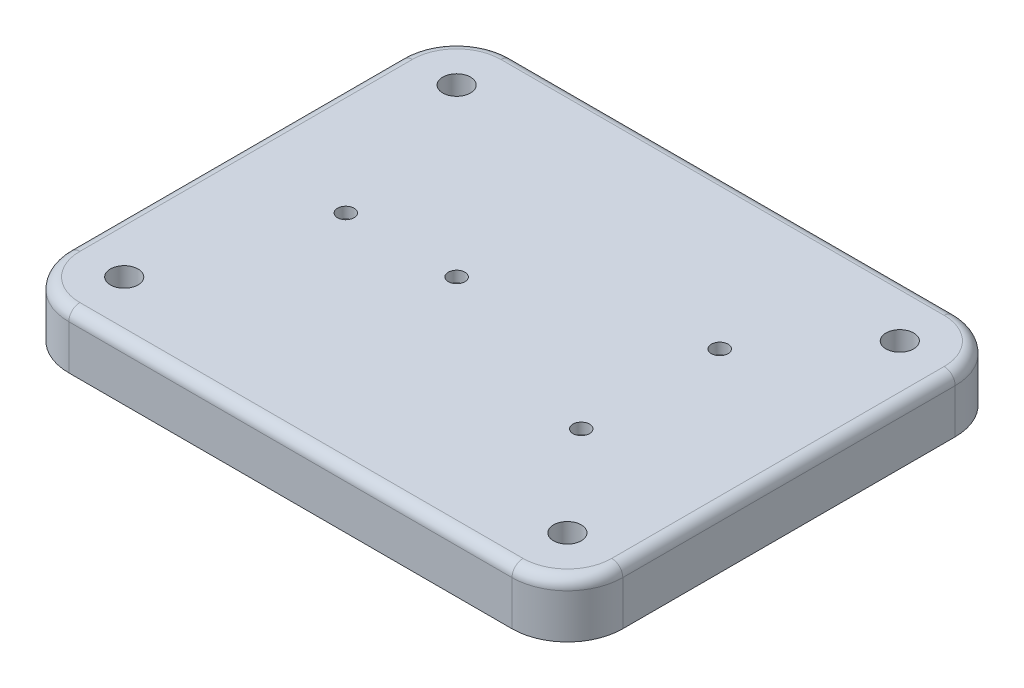
ISO-10303-21;
HEADER;
FILE_DESCRIPTION(('STEP AP214'),'2;1');
FILE_NAME('part.step','',(''),(''),'','','');
FILE_SCHEMA(('AUTOMOTIVE_DESIGN { 1 0 10303 214 1 1 1 1 }'));
ENDSEC;
DATA;
#1=APPLICATION_CONTEXT('core data for automotive mechanical design processes');
#2=APPLICATION_PROTOCOL_DEFINITION('international standard','automotive_design',2000,#1);
#3=PRODUCT_CONTEXT('',#1,'mechanical');
#4=PRODUCT('Part','Part','',(#3));
#5=PRODUCT_RELATED_PRODUCT_CATEGORY('part','',(#4));
#6=PRODUCT_DEFINITION_FORMATION('','',#4);
#7=PRODUCT_DEFINITION_CONTEXT('part definition',#1,'design');
#8=PRODUCT_DEFINITION('design','',#6,#7);
#9=PRODUCT_DEFINITION_SHAPE('','',#8);
#10=(LENGTH_UNIT() NAMED_UNIT(*) SI_UNIT(.MILLI.,.METRE.));
#11=(NAMED_UNIT(*) PLANE_ANGLE_UNIT() SI_UNIT($,.RADIAN.));
#12=(NAMED_UNIT(*) SI_UNIT($,.STERADIAN.) SOLID_ANGLE_UNIT());
#13=UNCERTAINTY_MEASURE_WITH_UNIT(LENGTH_MEASURE(1.E-05),#10,'distance_accuracy_value','');
#14=(GEOMETRIC_REPRESENTATION_CONTEXT(3) GLOBAL_UNCERTAINTY_ASSIGNED_CONTEXT((#13)) GLOBAL_UNIT_ASSIGNED_CONTEXT((#10,
#11,#12)) REPRESENTATION_CONTEXT('',''));
#15=CARTESIAN_POINT('',(0.,0.,0.));
#16=DIRECTION('',(0.,0.,1.));
#17=DIRECTION('',(1.,0.,0.));
#18=AXIS2_PLACEMENT_3D('',#15,#16,#17);
#19=CARTESIAN_POINT('',(0.,0.,0.));
#20=DIRECTION('',(0.,-1.,0.));
#21=DIRECTION('',(0.,0.,-1.));
#22=AXIS2_PLACEMENT_3D('',#19,#20,#21);
#23=PLANE('',#22);
#24=CARTESIAN_POINT('',(-40.,0.,30.));
#25=DIRECTION('',(0.,-1.,0.));
#26=DIRECTION('',(0.,0.,-1.));
#27=AXIS2_PLACEMENT_3D('',#24,#25,#26);
#28=CIRCLE('',#27,4.5);
#29=CARTESIAN_POINT('',(-40.,0.,25.5));
#30=VERTEX_POINT('',#29);
#31=EDGE_CURVE('E245',#30,#30,#28,.F.);
#32=ORIENTED_EDGE('',*,*,#31,.F.);
#33=EDGE_LOOP('',(#32));
#34=FACE_BOUND('',#33,.T.);
#35=CARTESIAN_POINT('',(-40.,0.,30.));
#36=DIRECTION('',(0.,1.,0.));
#37=DIRECTION('',(0.,0.,1.));
#38=AXIS2_PLACEMENT_3D('',#35,#36,#37);
#39=CIRCLE('',#38,2.5);
#40=CARTESIAN_POINT('',(-40.,0.,32.5));
#41=VERTEX_POINT('',#40);
#42=EDGE_CURVE('E319',#41,#41,#39,.T.);
#43=ORIENTED_EDGE('',*,*,#42,.T.);
#44=EDGE_LOOP('',(#43));
#45=FACE_BOUND('',#44,.T.);
#46=ADVANCED_FACE('F39',(#34,#45),#23,.T.);
#47=CARTESIAN_POINT('',(40.,0.,-30.));
#48=DIRECTION('',(0.,-1.,0.));
#49=DIRECTION('',(0.,0.,-1.));
#50=AXIS2_PLACEMENT_3D('',#47,#48,#49);
#51=CIRCLE('',#50,4.5);
#52=CARTESIAN_POINT('',(40.,0.,-34.5));
#53=VERTEX_POINT('',#52);
#54=EDGE_CURVE('E246',#53,#53,#51,.F.);
#55=ORIENTED_EDGE('',*,*,#54,.F.);
#56=EDGE_LOOP('',(#55));
#57=FACE_BOUND('',#56,.T.);
#58=CARTESIAN_POINT('',(40.,0.,-30.));
#59=DIRECTION('',(0.,1.,0.));
#60=DIRECTION('',(0.,0.,1.));
#61=AXIS2_PLACEMENT_3D('',#58,#59,#60);
#62=CIRCLE('',#61,2.5);
#63=CARTESIAN_POINT('',(40.,0.,-27.5));
#64=VERTEX_POINT('',#63);
#65=EDGE_CURVE('E328',#64,#64,#62,.T.);
#66=ORIENTED_EDGE('',*,*,#65,.T.);
#67=EDGE_LOOP('',(#66));
#68=FACE_BOUND('',#67,.T.);
#69=ADVANCED_FACE('F564',(#57,#68),#23,.T.);
#70=CARTESIAN_POINT('',(40.,0.,30.));
#71=DIRECTION('',(0.,-1.,0.));
#72=DIRECTION('',(0.,0.,-1.));
#73=AXIS2_PLACEMENT_3D('',#70,#71,#72);
#74=CIRCLE('',#73,4.5);
#75=CARTESIAN_POINT('',(40.,0.,25.5));
#76=VERTEX_POINT('',#75);
#77=EDGE_CURVE('E251',#76,#76,#74,.F.);
#78=ORIENTED_EDGE('',*,*,#77,.F.);
#79=EDGE_LOOP('',(#78));
#80=FACE_BOUND('',#79,.T.);
#81=CARTESIAN_POINT('',(40.,0.,30.));
#82=DIRECTION('',(0.,1.,0.));
#83=DIRECTION('',(0.,0.,1.));
#84=AXIS2_PLACEMENT_3D('',#81,#82,#83);
#85=CIRCLE('',#84,2.5);
#86=CARTESIAN_POINT('',(40.,0.,32.5));
#87=VERTEX_POINT('',#86);
#88=EDGE_CURVE('E309',#87,#87,#85,.T.);
#89=ORIENTED_EDGE('',*,*,#88,.T.);
#90=EDGE_LOOP('',(#89));
#91=FACE_BOUND('',#90,.T.);
#92=ADVANCED_FACE('F570',(#80,#91),#23,.T.);
#93=DIRECTION('',(0.,0.,-1.));
#94=VECTOR('',#93,1.);
#95=CARTESIAN_POINT('',(50.,0.,40.));
#96=LINE('',#95,#94);
#97=CARTESIAN_POINT('',(50.,0.,30.));
#98=VERTEX_POINT('',#97);
#99=CARTESIAN_POINT('',(50.,0.,-30.));
#100=VERTEX_POINT('',#99);
#101=EDGE_CURVE('E339',#98,#100,#96,.T.);
#102=ORIENTED_EDGE('',*,*,#101,.F.);
#103=CARTESIAN_POINT('',(40.,0.,30.));
#104=DIRECTION('',(0.,-1.,0.));
#105=DIRECTION('',(0.,0.,-1.));
#106=AXIS2_PLACEMENT_3D('',#103,#104,#105);
#107=CIRCLE('',#106,10.);
#108=CARTESIAN_POINT('',(40.,0.,40.));
#109=VERTEX_POINT('',#108);
#110=EDGE_CURVE('E374',#98,#109,#107,.T.);
#111=ORIENTED_EDGE('',*,*,#110,.T.);
#112=DIRECTION('',(1.,0.,0.));
#113=VECTOR('',#112,1.);
#114=CARTESIAN_POINT('',(-50.,0.,40.));
#115=LINE('',#114,#113);
#116=CARTESIAN_POINT('',(-40.,0.,40.));
#117=VERTEX_POINT('',#116);
#118=EDGE_CURVE('E354',#117,#109,#115,.T.);
#119=ORIENTED_EDGE('',*,*,#118,.F.);
#120=CARTESIAN_POINT('',(-40.,0.,30.));
#121=DIRECTION('',(0.,-1.,0.));
#122=DIRECTION('',(0.,0.,-1.));
#123=AXIS2_PLACEMENT_3D('',#120,#121,#122);
#124=CIRCLE('',#123,10.);
#125=CARTESIAN_POINT('',(-50.,0.,30.));
#126=VERTEX_POINT('',#125);
#127=EDGE_CURVE('E365',#117,#126,#124,.T.);
#128=ORIENTED_EDGE('',*,*,#127,.T.);
#129=DIRECTION('',(0.,0.,1.));
#130=VECTOR('',#129,1.);
#131=CARTESIAN_POINT('',(-50.,0.,40.));
#132=LINE('',#131,#130);
#133=CARTESIAN_POINT('',(-50.,0.,-30.));
#134=VERTEX_POINT('',#133);
#135=EDGE_CURVE('E350',#134,#126,#132,.T.);
#136=ORIENTED_EDGE('',*,*,#135,.F.);
#137=CARTESIAN_POINT('',(-40.,0.,-30.));
#138=DIRECTION('',(0.,-1.,0.));
#139=DIRECTION('',(0.,0.,-1.));
#140=AXIS2_PLACEMENT_3D('',#137,#138,#139);
#141=CIRCLE('',#140,10.);
#142=CARTESIAN_POINT('',(-40.,0.,-40.));
#143=VERTEX_POINT('',#142);
#144=EDGE_CURVE('E368',#134,#143,#141,.T.);
#145=ORIENTED_EDGE('',*,*,#144,.T.);
#146=DIRECTION('',(-1.,0.,0.));
#147=VECTOR('',#146,1.);
#148=CARTESIAN_POINT('',(-50.,0.,-40.));
#149=LINE('',#148,#147);
#150=CARTESIAN_POINT('',(40.,0.,-40.));
#151=VERTEX_POINT('',#150);
#152=EDGE_CURVE('E346',#151,#143,#149,.T.);
#153=ORIENTED_EDGE('',*,*,#152,.F.);
#154=CARTESIAN_POINT('',(40.,0.,-30.));
#155=DIRECTION('',(0.,-1.,0.));
#156=DIRECTION('',(0.,0.,-1.));
#157=AXIS2_PLACEMENT_3D('',#154,#155,#156);
#158=CIRCLE('',#157,10.);
#159=EDGE_CURVE('E371',#151,#100,#158,.T.);
#160=ORIENTED_EDGE('',*,*,#159,.T.);
#161=EDGE_LOOP('',(#102,#111,#119,#128,#136,#145,#153,#160));
#162=FACE_BOUND('',#161,.T.);
#163=CARTESIAN_POINT('',(40.,0.,30.));
#164=DIRECTION('',(0.,-1.,0.));
#165=DIRECTION('',(0.,0.,-1.));
#166=AXIS2_PLACEMENT_3D('',#163,#164,#165);
#167=CIRCLE('',#166,8.);
#168=CARTESIAN_POINT('',(48.,0.,30.));
#169=VERTEX_POINT('',#168);
#170=CARTESIAN_POINT('',(40.,0.,38.));
#171=VERTEX_POINT('',#170);
#172=EDGE_CURVE('E277',#169,#171,#167,.T.);
#173=ORIENTED_EDGE('',*,*,#172,.F.);
#174=DIRECTION('',(0.,0.,-1.));
#175=VECTOR('',#174,1.);
#176=CARTESIAN_POINT('',(48.,0.,0.));
#177=LINE('',#176,#175);
#178=CARTESIAN_POINT('',(48.,0.,-30.));
#179=VERTEX_POINT('',#178);
#180=EDGE_CURVE('E280',#169,#179,#177,.T.);
#181=ORIENTED_EDGE('',*,*,#180,.T.);
#182=CARTESIAN_POINT('',(40.,0.,-30.));
#183=DIRECTION('',(0.,-1.,0.));
#184=DIRECTION('',(0.,0.,-1.));
#185=AXIS2_PLACEMENT_3D('',#182,#183,#184);
#186=CIRCLE('',#185,8.);
#187=CARTESIAN_POINT('',(40.,0.,-38.));
#188=VERTEX_POINT('',#187);
#189=EDGE_CURVE('E206',#188,#179,#186,.T.);
#190=ORIENTED_EDGE('',*,*,#189,.F.);
#191=DIRECTION('',(-1.,0.,0.));
#192=VECTOR('',#191,1.);
#193=CARTESIAN_POINT('',(0.,0.,-38.));
#194=LINE('',#193,#192);
#195=CARTESIAN_POINT('',(-40.,0.,-38.));
#196=VERTEX_POINT('',#195);
#197=EDGE_CURVE('E57',#188,#196,#194,.T.);
#198=ORIENTED_EDGE('',*,*,#197,.T.);
#199=CARTESIAN_POINT('',(-40.,0.,-30.));
#200=DIRECTION('',(0.,-1.,0.));
#201=DIRECTION('',(0.,0.,-1.));
#202=AXIS2_PLACEMENT_3D('',#199,#200,#201);
#203=CIRCLE('',#202,8.);
#204=CARTESIAN_POINT('',(-48.,0.,-30.));
#205=VERTEX_POINT('',#204);
#206=EDGE_CURVE('E287',#205,#196,#203,.T.);
#207=ORIENTED_EDGE('',*,*,#206,.F.);
#208=DIRECTION('',(0.,0.,1.));
#209=VECTOR('',#208,1.);
#210=CARTESIAN_POINT('',(-48.,0.,0.));
#211=LINE('',#210,#209);
#212=CARTESIAN_POINT('',(-48.,0.,30.));
#213=VERTEX_POINT('',#212);
#214=EDGE_CURVE('E215',#205,#213,#211,.T.);
#215=ORIENTED_EDGE('',*,*,#214,.T.);
#216=CARTESIAN_POINT('',(-40.,0.,30.));
#217=DIRECTION('',(0.,-1.,0.));
#218=DIRECTION('',(0.,0.,-1.));
#219=AXIS2_PLACEMENT_3D('',#216,#217,#218);
#220=CIRCLE('',#219,8.);
#221=CARTESIAN_POINT('',(-40.,0.,38.));
#222=VERTEX_POINT('',#221);
#223=EDGE_CURVE('E212',#222,#213,#220,.T.);
#224=ORIENTED_EDGE('',*,*,#223,.F.);
#225=DIRECTION('',(1.,0.,0.));
#226=VECTOR('',#225,1.);
#227=CARTESIAN_POINT('',(0.,0.,38.));
#228=LINE('',#227,#226);
#229=EDGE_CURVE('E208',#222,#171,#228,.T.);
#230=ORIENTED_EDGE('',*,*,#229,.T.);
#231=EDGE_LOOP('',(#173,#181,#190,#198,#207,#215,#224,#230));
#232=FACE_BOUND('',#231,.T.);
#233=ADVANCED_FACE('F578',(#162,#232),#23,.T.);
#234=CARTESIAN_POINT('',(50.,10.,40.));
#235=DIRECTION('',(-1.,0.,0.));
#236=DIRECTION('',(0.,0.,1.));
#237=AXIS2_PLACEMENT_3D('',#234,#235,#236);
#238=PLANE('',#237);
#239=DIRECTION('',(0.,-1.,0.));
#240=VECTOR('',#239,1.);
#241=CARTESIAN_POINT('',(50.,10.,-30.));
#242=LINE('',#241,#240);
#243=CARTESIAN_POINT('',(50.,8.,-30.));
#244=VERTEX_POINT('',#243);
#245=EDGE_CURVE('E358',#100,#244,#242,.F.);
#246=ORIENTED_EDGE('',*,*,#245,.T.);
#247=DIRECTION('',(0.,0.,-1.));
#248=VECTOR('',#247,1.);
#249=CARTESIAN_POINT('',(50.,8.,40.));
#250=LINE('',#249,#248);
#251=CARTESIAN_POINT('',(50.,8.,30.));
#252=VERTEX_POINT('',#251);
#253=EDGE_CURVE('E426',#244,#252,#250,.F.);
#254=ORIENTED_EDGE('',*,*,#253,.T.);
#255=DIRECTION('',(0.,-1.,0.));
#256=VECTOR('',#255,1.);
#257=CARTESIAN_POINT('',(50.,10.,30.));
#258=LINE('',#257,#256);
#259=EDGE_CURVE('E362',#252,#98,#258,.T.);
#260=ORIENTED_EDGE('',*,*,#259,.T.);
#261=ORIENTED_EDGE('',*,*,#101,.T.);
#262=EDGE_LOOP('',(#246,#254,#260,#261));
#263=FACE_BOUND('',#262,.T.);
#264=ADVANCED_FACE('F588',(#263),#238,.F.);
#265=CARTESIAN_POINT('',(-50.,10.,-40.));
#266=DIRECTION('',(0.,0.,1.));
#267=DIRECTION('',(1.,0.,0.));
#268=AXIS2_PLACEMENT_3D('',#265,#266,#267);
#269=PLANE('',#268);
#270=DIRECTION('',(0.,-1.,0.));
#271=VECTOR('',#270,1.);
#272=CARTESIAN_POINT('',(-40.,10.,-40.));
#273=LINE('',#272,#271);
#274=CARTESIAN_POINT('',(-40.,8.,-40.));
#275=VERTEX_POINT('',#274);
#276=EDGE_CURVE('E383',#143,#275,#273,.F.);
#277=ORIENTED_EDGE('',*,*,#276,.T.);
#278=DIRECTION('',(-1.,0.,0.));
#279=VECTOR('',#278,1.);
#280=CARTESIAN_POINT('',(-50.,8.,-40.));
#281=LINE('',#280,#279);
#282=CARTESIAN_POINT('',(40.,8.,-40.));
#283=VERTEX_POINT('',#282);
#284=EDGE_CURVE('E432',#275,#283,#281,.F.);
#285=ORIENTED_EDGE('',*,*,#284,.T.);
#286=DIRECTION('',(0.,-1.,0.));
#287=VECTOR('',#286,1.);
#288=CARTESIAN_POINT('',(40.,10.,-40.));
#289=LINE('',#288,#287);
#290=EDGE_CURVE('E387',#283,#151,#289,.T.);
#291=ORIENTED_EDGE('',*,*,#290,.T.);
#292=ORIENTED_EDGE('',*,*,#152,.T.);
#293=EDGE_LOOP('',(#277,#285,#291,#292));
#294=FACE_BOUND('',#293,.T.);
#295=ADVANCED_FACE('F594',(#294),#269,.F.);
#296=CARTESIAN_POINT('',(-50.,10.,40.));
#297=DIRECTION('',(1.,0.,0.));
#298=DIRECTION('',(0.,0.,-1.));
#299=AXIS2_PLACEMENT_3D('',#296,#297,#298);
#300=PLANE('',#299);
#301=DIRECTION('',(0.,-1.,0.));
#302=VECTOR('',#301,1.);
#303=CARTESIAN_POINT('',(-50.,10.,30.));
#304=LINE('',#303,#302);
#305=CARTESIAN_POINT('',(-50.,8.,30.));
#306=VERTEX_POINT('',#305);
#307=EDGE_CURVE('E390',#126,#306,#304,.F.);
#308=ORIENTED_EDGE('',*,*,#307,.T.);
#309=DIRECTION('',(0.,0.,1.));
#310=VECTOR('',#309,1.);
#311=CARTESIAN_POINT('',(-50.,8.,40.));
#312=LINE('',#311,#310);
#313=CARTESIAN_POINT('',(-50.,8.,-30.));
#314=VERTEX_POINT('',#313);
#315=EDGE_CURVE('E438',#306,#314,#312,.F.);
#316=ORIENTED_EDGE('',*,*,#315,.T.);
#317=DIRECTION('',(0.,-1.,0.));
#318=VECTOR('',#317,1.);
#319=CARTESIAN_POINT('',(-50.,10.,-30.));
#320=LINE('',#319,#318);
#321=EDGE_CURVE('E394',#314,#134,#320,.T.);
#322=ORIENTED_EDGE('',*,*,#321,.T.);
#323=ORIENTED_EDGE('',*,*,#135,.T.);
#324=EDGE_LOOP('',(#308,#316,#322,#323));
#325=FACE_BOUND('',#324,.T.);
#326=ADVANCED_FACE('F858',(#325),#300,.F.);
#327=CARTESIAN_POINT('',(-50.,10.,40.));
#328=DIRECTION('',(0.,0.,-1.));
#329=DIRECTION('',(-1.,0.,0.));
#330=AXIS2_PLACEMENT_3D('',#327,#328,#329);
#331=PLANE('',#330);
#332=DIRECTION('',(0.,-1.,0.));
#333=VECTOR('',#332,1.);
#334=CARTESIAN_POINT('',(40.,10.,40.));
#335=LINE('',#334,#333);
#336=CARTESIAN_POINT('',(40.,8.,40.));
#337=VERTEX_POINT('',#336);
#338=EDGE_CURVE('E380',#109,#337,#335,.F.);
#339=ORIENTED_EDGE('',*,*,#338,.T.);
#340=DIRECTION('',(1.,0.,0.));
#341=VECTOR('',#340,1.);
#342=CARTESIAN_POINT('',(-50.,8.,40.));
#343=LINE('',#342,#341);
#344=CARTESIAN_POINT('',(-40.,8.,40.));
#345=VERTEX_POINT('',#344);
#346=EDGE_CURVE('E11',#337,#345,#343,.F.);
#347=ORIENTED_EDGE('',*,*,#346,.T.);
#348=DIRECTION('',(0.,-1.,0.));
#349=VECTOR('',#348,1.);
#350=CARTESIAN_POINT('',(-40.,10.,40.));
#351=LINE('',#350,#349);
#352=EDGE_CURVE('E377',#345,#117,#351,.T.);
#353=ORIENTED_EDGE('',*,*,#352,.T.);
#354=ORIENTED_EDGE('',*,*,#118,.T.);
#355=EDGE_LOOP('',(#339,#347,#353,#354));
#356=FACE_BOUND('',#355,.T.);
#357=ADVANCED_FACE('F529',(#356),#331,.F.);
#358=CARTESIAN_POINT('',(0.,10.,0.));
#359=DIRECTION('',(0.,-1.,0.));
#360=DIRECTION('',(0.,0.,-1.));
#361=AXIS2_PLACEMENT_3D('',#358,#359,#360);
#362=PLANE('',#361);
#363=CARTESIAN_POINT('',(25.,10.,12.5));
#364=DIRECTION('',(0.,1.,0.));
#365=DIRECTION('',(0.,0.,1.));
#366=AXIS2_PLACEMENT_3D('',#363,#364,#365);
#367=CIRCLE('',#366,1.5);
#368=CARTESIAN_POINT('',(25.,10.,14.));
#369=VERTEX_POINT('',#368);
#370=EDGE_CURVE('E519',#369,#369,#367,.T.);
#371=ORIENTED_EDGE('',*,*,#370,.F.);
#372=EDGE_LOOP('',(#371));
#373=FACE_BOUND('',#372,.T.);
#374=CARTESIAN_POINT('',(25.,10.,-12.5));
#375=DIRECTION('',(0.,1.,0.));
#376=DIRECTION('',(0.,0.,1.));
#377=AXIS2_PLACEMENT_3D('',#374,#375,#376);
#378=CIRCLE('',#377,1.5);
#379=CARTESIAN_POINT('',(25.,10.,-11.));
#380=VERTEX_POINT('',#379);
#381=EDGE_CURVE('E513',#380,#380,#378,.T.);
#382=ORIENTED_EDGE('',*,*,#381,.F.);
#383=EDGE_LOOP('',(#382));
#384=FACE_BOUND('',#383,.T.);
#385=CARTESIAN_POINT('',(-30.,10.,0.));
#386=DIRECTION('',(0.,1.,0.));
#387=DIRECTION('',(0.,0.,1.));
#388=AXIS2_PLACEMENT_3D('',#385,#386,#387);
#389=CIRCLE('',#388,1.5);
#390=CARTESIAN_POINT('',(-30.,10.,1.5));
#391=VERTEX_POINT('',#390);
#392=EDGE_CURVE('E510',#391,#391,#389,.T.);
#393=ORIENTED_EDGE('',*,*,#392,.F.);
#394=EDGE_LOOP('',(#393));
#395=FACE_BOUND('',#394,.T.);
#396=CARTESIAN_POINT('',(-10.,10.,0.));
#397=DIRECTION('',(0.,1.,0.));
#398=DIRECTION('',(0.,0.,1.));
#399=AXIS2_PLACEMENT_3D('',#396,#397,#398);
#400=CIRCLE('',#399,1.5);
#401=CARTESIAN_POINT('',(-10.,10.,1.5));
#402=VERTEX_POINT('',#401);
#403=EDGE_CURVE('E218',#402,#402,#400,.T.);
#404=ORIENTED_EDGE('',*,*,#403,.F.);
#405=EDGE_LOOP('',(#404));
#406=FACE_BOUND('',#405,.T.);
#407=DIRECTION('',(1.,0.,0.));
#408=VECTOR('',#407,1.);
#409=CARTESIAN_POINT('',(0.,10.,38.));
#410=LINE('',#409,#408);
#411=CARTESIAN_POINT('',(-40.,10.,38.));
#412=VERTEX_POINT('',#411);
#413=CARTESIAN_POINT('',(40.,10.,38.));
#414=VERTEX_POINT('',#413);
#415=EDGE_CURVE('E397',#412,#414,#410,.T.);
#416=ORIENTED_EDGE('',*,*,#415,.T.);
#417=CARTESIAN_POINT('',(40.,10.,30.));
#418=DIRECTION('',(0.,-1.,0.));
#419=DIRECTION('',(0.,0.,-1.));
#420=AXIS2_PLACEMENT_3D('',#417,#418,#419);
#421=CIRCLE('',#420,8.);
#422=CARTESIAN_POINT('',(48.,10.,30.));
#423=VERTEX_POINT('',#422);
#424=EDGE_CURVE('E418',#414,#423,#421,.F.);
#425=ORIENTED_EDGE('',*,*,#424,.T.);
#426=DIRECTION('',(0.,0.,-1.));
#427=VECTOR('',#426,1.);
#428=CARTESIAN_POINT('',(48.,10.,0.));
#429=LINE('',#428,#427);
#430=CARTESIAN_POINT('',(48.,10.,-30.));
#431=VERTEX_POINT('',#430);
#432=EDGE_CURVE('E415',#423,#431,#429,.T.);
#433=ORIENTED_EDGE('',*,*,#432,.T.);
#434=CARTESIAN_POINT('',(40.,10.,-30.));
#435=DIRECTION('',(0.,-1.,0.));
#436=DIRECTION('',(0.,0.,-1.));
#437=AXIS2_PLACEMENT_3D('',#434,#435,#436);
#438=CIRCLE('',#437,8.);
#439=CARTESIAN_POINT('',(40.,10.,-38.));
#440=VERTEX_POINT('',#439);
#441=EDGE_CURVE('E412',#431,#440,#438,.F.);
#442=ORIENTED_EDGE('',*,*,#441,.T.);
#443=DIRECTION('',(-1.,0.,0.));
#444=VECTOR('',#443,1.);
#445=CARTESIAN_POINT('',(0.,10.,-38.));
#446=LINE('',#445,#444);
#447=CARTESIAN_POINT('',(-40.,10.,-38.));
#448=VERTEX_POINT('',#447);
#449=EDGE_CURVE('E409',#440,#448,#446,.T.);
#450=ORIENTED_EDGE('',*,*,#449,.T.);
#451=CARTESIAN_POINT('',(-40.,10.,-30.));
#452=DIRECTION('',(0.,-1.,0.));
#453=DIRECTION('',(0.,0.,-1.));
#454=AXIS2_PLACEMENT_3D('',#451,#452,#453);
#455=CIRCLE('',#454,8.);
#456=CARTESIAN_POINT('',(-48.,10.,-30.));
#457=VERTEX_POINT('',#456);
#458=EDGE_CURVE('E406',#448,#457,#455,.F.);
#459=ORIENTED_EDGE('',*,*,#458,.T.);
#460=DIRECTION('',(0.,0.,1.));
#461=VECTOR('',#460,1.);
#462=CARTESIAN_POINT('',(-48.,10.,0.));
#463=LINE('',#462,#461);
#464=CARTESIAN_POINT('',(-48.,10.,30.));
#465=VERTEX_POINT('',#464);
#466=EDGE_CURVE('E403',#457,#465,#463,.T.);
#467=ORIENTED_EDGE('',*,*,#466,.T.);
#468=CARTESIAN_POINT('',(-40.,10.,30.));
#469=DIRECTION('',(0.,-1.,0.));
#470=DIRECTION('',(0.,0.,-1.));
#471=AXIS2_PLACEMENT_3D('',#468,#469,#470);
#472=CIRCLE('',#471,8.);
#473=EDGE_CURVE('E400',#465,#412,#472,.F.);
#474=ORIENTED_EDGE('',*,*,#473,.T.);
#475=EDGE_LOOP('',(#416,#425,#433,#442,#450,#459,#467,#474));
#476=FACE_BOUND('',#475,.T.);
#477=CARTESIAN_POINT('',(-40.,10.,30.));
#478=DIRECTION('',(0.,1.,0.));
#479=DIRECTION('',(0.,0.,1.));
#480=AXIS2_PLACEMENT_3D('',#477,#478,#479);
#481=CIRCLE('',#480,2.5);
#482=CARTESIAN_POINT('',(-40.,10.,32.5));
#483=VERTEX_POINT('',#482);
#484=EDGE_CURVE('E324',#483,#483,#481,.T.);
#485=ORIENTED_EDGE('',*,*,#484,.F.);
#486=EDGE_LOOP('',(#485));
#487=FACE_BOUND('',#486,.T.);
#488=CARTESIAN_POINT('',(40.,10.,-30.));
#489=DIRECTION('',(0.,1.,0.));
#490=DIRECTION('',(0.,0.,1.));
#491=AXIS2_PLACEMENT_3D('',#488,#489,#490);
#492=CIRCLE('',#491,2.5);
#493=CARTESIAN_POINT('',(40.,10.,-27.5));
#494=VERTEX_POINT('',#493);
#495=EDGE_CURVE('E313',#494,#494,#492,.T.);
#496=ORIENTED_EDGE('',*,*,#495,.F.);
#497=EDGE_LOOP('',(#496));
#498=FACE_BOUND('',#497,.T.);
#499=CARTESIAN_POINT('',(40.,10.,30.));
#500=DIRECTION('',(0.,1.,0.));
#501=DIRECTION('',(0.,0.,1.));
#502=AXIS2_PLACEMENT_3D('',#499,#500,#501);
#503=CIRCLE('',#502,2.5);
#504=CARTESIAN_POINT('',(40.,10.,32.5));
#505=VERTEX_POINT('',#504);
#506=EDGE_CURVE('E314',#505,#505,#503,.T.);
#507=ORIENTED_EDGE('',*,*,#506,.F.);
#508=EDGE_LOOP('',(#507));
#509=FACE_BOUND('',#508,.T.);
#510=CARTESIAN_POINT('',(-40.,10.,-30.));
#511=DIRECTION('',(0.,1.,0.));
#512=DIRECTION('',(0.,0.,1.));
#513=AXIS2_PLACEMENT_3D('',#510,#511,#512);
#514=CIRCLE('',#513,2.5);
#515=CARTESIAN_POINT('',(-40.,10.,-27.5));
#516=VERTEX_POINT('',#515);
#517=EDGE_CURVE('E323',#516,#516,#514,.T.);
#518=ORIENTED_EDGE('',*,*,#517,.F.);
#519=EDGE_LOOP('',(#518));
#520=FACE_BOUND('',#519,.T.);
#521=ADVANCED_FACE('F525',(#373,#384,#395,#406,#476,#487,#498,#509,#520),#362,.F.);
#522=CARTESIAN_POINT('',(-40.,0.,-30.));
#523=DIRECTION('',(0.,-1.,0.));
#524=DIRECTION('',(0.,0.,-1.));
#525=AXIS2_PLACEMENT_3D('',#522,#523,#524);
#526=CIRCLE('',#525,4.5);
#527=CARTESIAN_POINT('',(-40.,0.,-34.5));
#528=VERTEX_POINT('',#527);
#529=EDGE_CURVE('E260',#528,#528,#526,.F.);
#530=ORIENTED_EDGE('',*,*,#529,.F.);
#531=EDGE_LOOP('',(#530));
#532=FACE_BOUND('',#531,.T.);
#533=CARTESIAN_POINT('',(-40.,0.,-30.));
#534=DIRECTION('',(0.,1.,0.));
#535=DIRECTION('',(0.,0.,1.));
#536=AXIS2_PLACEMENT_3D('',#533,#534,#535);
#537=CIRCLE('',#536,2.5);
#538=CARTESIAN_POINT('',(-40.,0.,-27.5));
#539=VERTEX_POINT('',#538);
#540=EDGE_CURVE('E335',#539,#539,#537,.T.);
#541=ORIENTED_EDGE('',*,*,#540,.T.);
#542=EDGE_LOOP('',(#541));
#543=FACE_BOUND('',#542,.T.);
#544=ADVANCED_FACE('F528',(#532,#543),#23,.T.);
#545=CARTESIAN_POINT('',(40.,10.,30.));
#546=DIRECTION('',(0.,-1.,0.));
#547=DIRECTION('',(0.,0.,-1.));
#548=AXIS2_PLACEMENT_3D('',#545,#546,#547);
#549=CYLINDRICAL_SURFACE('',#548,10.);
#550=ORIENTED_EDGE('',*,*,#259,.F.);
#551=CARTESIAN_POINT('',(40.,8.,30.));
#552=DIRECTION('',(0.,-1.,0.));
#553=DIRECTION('',(0.,0.,-1.));
#554=AXIS2_PLACEMENT_3D('',#551,#552,#553);
#555=CIRCLE('',#554,10.);
#556=EDGE_CURVE('E422',#252,#337,#555,.T.);
#557=ORIENTED_EDGE('',*,*,#556,.T.);
#558=ORIENTED_EDGE('',*,*,#338,.F.);
#559=ORIENTED_EDGE('',*,*,#110,.F.);
#560=EDGE_LOOP('',(#550,#557,#558,#559));
#561=FACE_BOUND('',#560,.T.);
#562=ADVANCED_FACE('F576',(#561),#549,.T.);
#563=CARTESIAN_POINT('',(40.,10.,-30.));
#564=DIRECTION('',(0.,-1.,0.));
#565=DIRECTION('',(0.,0.,-1.));
#566=AXIS2_PLACEMENT_3D('',#563,#564,#565);
#567=CYLINDRICAL_SURFACE('',#566,10.);
#568=ORIENTED_EDGE('',*,*,#290,.F.);
#569=CARTESIAN_POINT('',(40.,8.,-30.));
#570=DIRECTION('',(0.,-1.,0.));
#571=DIRECTION('',(0.,0.,-1.));
#572=AXIS2_PLACEMENT_3D('',#569,#570,#571);
#573=CIRCLE('',#572,10.);
#574=EDGE_CURVE('E429',#283,#244,#573,.T.);
#575=ORIENTED_EDGE('',*,*,#574,.T.);
#576=ORIENTED_EDGE('',*,*,#245,.F.);
#577=ORIENTED_EDGE('',*,*,#159,.F.);
#578=EDGE_LOOP('',(#568,#575,#576,#577));
#579=FACE_BOUND('',#578,.T.);
#580=ADVANCED_FACE('F582',(#579),#567,.T.);
#581=CARTESIAN_POINT('',(-40.,10.,-30.));
#582=DIRECTION('',(0.,-1.,0.));
#583=DIRECTION('',(0.,0.,-1.));
#584=AXIS2_PLACEMENT_3D('',#581,#582,#583);
#585=CYLINDRICAL_SURFACE('',#584,10.);
#586=ORIENTED_EDGE('',*,*,#321,.F.);
#587=CARTESIAN_POINT('',(-40.,8.,-30.));
#588=DIRECTION('',(0.,-1.,0.));
#589=DIRECTION('',(0.,0.,-1.));
#590=AXIS2_PLACEMENT_3D('',#587,#588,#589);
#591=CIRCLE('',#590,10.);
#592=EDGE_CURVE('E435',#314,#275,#591,.T.);
#593=ORIENTED_EDGE('',*,*,#592,.T.);
#594=ORIENTED_EDGE('',*,*,#276,.F.);
#595=ORIENTED_EDGE('',*,*,#144,.F.);
#596=EDGE_LOOP('',(#586,#593,#594,#595));
#597=FACE_BOUND('',#596,.T.);
#598=ADVANCED_FACE('F558',(#597),#585,.T.);
#599=CARTESIAN_POINT('',(-40.,10.,30.));
#600=DIRECTION('',(0.,-1.,0.));
#601=DIRECTION('',(0.,0.,-1.));
#602=AXIS2_PLACEMENT_3D('',#599,#600,#601);
#603=CYLINDRICAL_SURFACE('',#602,10.);
#604=ORIENTED_EDGE('',*,*,#352,.F.);
#605=CARTESIAN_POINT('',(-40.,8.,30.));
#606=DIRECTION('',(0.,-1.,0.));
#607=DIRECTION('',(0.,0.,-1.));
#608=AXIS2_PLACEMENT_3D('',#605,#606,#607);
#609=CIRCLE('',#608,10.);
#610=EDGE_CURVE('E49',#345,#306,#609,.T.);
#611=ORIENTED_EDGE('',*,*,#610,.T.);
#612=ORIENTED_EDGE('',*,*,#307,.F.);
#613=ORIENTED_EDGE('',*,*,#127,.F.);
#614=EDGE_LOOP('',(#604,#611,#612,#613));
#615=FACE_BOUND('',#614,.T.);
#616=ADVANCED_FACE('F548',(#615),#603,.T.);
#617=CARTESIAN_POINT('',(-40.,0.,-30.));
#618=DIRECTION('',(0.,1.,0.));
#619=DIRECTION('',(0.,0.,1.));
#620=AXIS2_PLACEMENT_3D('',#617,#618,#619);
#621=CYLINDRICAL_SURFACE('',#620,2.5);
#622=ORIENTED_EDGE('',*,*,#540,.F.);
#623=EDGE_LOOP('',(#622));
#624=FACE_BOUND('',#623,.T.);
#625=ORIENTED_EDGE('',*,*,#517,.T.);
#626=EDGE_LOOP('',(#625));
#627=FACE_BOUND('',#626,.T.);
#628=ADVANCED_FACE('F545',(#624,#627),#621,.F.);
#629=CARTESIAN_POINT('',(40.,0.,30.));
#630=DIRECTION('',(0.,1.,0.));
#631=DIRECTION('',(0.,0.,1.));
#632=AXIS2_PLACEMENT_3D('',#629,#630,#631);
#633=CYLINDRICAL_SURFACE('',#632,2.5);
#634=ORIENTED_EDGE('',*,*,#88,.F.);
#635=EDGE_LOOP('',(#634));
#636=FACE_BOUND('',#635,.T.);
#637=ORIENTED_EDGE('',*,*,#506,.T.);
#638=EDGE_LOOP('',(#637));
#639=FACE_BOUND('',#638,.T.);
#640=ADVANCED_FACE('F547',(#636,#639),#633,.F.);
#641=CARTESIAN_POINT('',(40.,0.,-30.));
#642=DIRECTION('',(0.,1.,0.));
#643=DIRECTION('',(0.,0.,1.));
#644=AXIS2_PLACEMENT_3D('',#641,#642,#643);
#645=CYLINDRICAL_SURFACE('',#644,2.5);
#646=ORIENTED_EDGE('',*,*,#65,.F.);
#647=EDGE_LOOP('',(#646));
#648=FACE_BOUND('',#647,.T.);
#649=ORIENTED_EDGE('',*,*,#495,.T.);
#650=EDGE_LOOP('',(#649));
#651=FACE_BOUND('',#650,.T.);
#652=ADVANCED_FACE('F555',(#648,#651),#645,.F.);
#653=CARTESIAN_POINT('',(-40.,0.,30.));
#654=DIRECTION('',(0.,1.,0.));
#655=DIRECTION('',(0.,0.,1.));
#656=AXIS2_PLACEMENT_3D('',#653,#654,#655);
#657=CYLINDRICAL_SURFACE('',#656,2.5);
#658=ORIENTED_EDGE('',*,*,#42,.F.);
#659=EDGE_LOOP('',(#658));
#660=FACE_BOUND('',#659,.T.);
#661=ORIENTED_EDGE('',*,*,#484,.T.);
#662=EDGE_LOOP('',(#661));
#663=FACE_BOUND('',#662,.T.);
#664=ADVANCED_FACE('F655',(#660,#663),#657,.F.);
#665=CARTESIAN_POINT('',(-40.,8.,-30.));
#666=DIRECTION('',(0.,-1.,0.));
#667=DIRECTION('',(0.,0.,-1.));
#668=AXIS2_PLACEMENT_3D('',#665,#666,#667);
#669=TOROIDAL_SURFACE('',#668,8.,2.);
#670=CARTESIAN_POINT('',(-40.,8.,-38.));
#671=DIRECTION('',(1.,0.,0.));
#672=DIRECTION('',(0.,0.,-1.));
#673=AXIS2_PLACEMENT_3D('',#670,#671,#672);
#674=CIRCLE('',#673,2.);
#675=EDGE_CURVE('E464',#275,#448,#674,.T.);
#676=ORIENTED_EDGE('',*,*,#675,.F.);
#677=ORIENTED_EDGE('',*,*,#592,.F.);
#678=CARTESIAN_POINT('',(-48.,8.,-30.));
#679=DIRECTION('',(0.,0.,1.));
#680=DIRECTION('',(1.,0.,0.));
#681=AXIS2_PLACEMENT_3D('',#678,#679,#680);
#682=CIRCLE('',#681,2.);
#683=EDGE_CURVE('E318',#457,#314,#682,.T.);
#684=ORIENTED_EDGE('',*,*,#683,.F.);
#685=ORIENTED_EDGE('',*,*,#458,.F.);
#686=EDGE_LOOP('',(#676,#677,#684,#685));
#687=FACE_BOUND('',#686,.T.);
#688=ADVANCED_FACE('F41',(#687),#669,.T.);
#689=CARTESIAN_POINT('',(-48.,8.,0.));
#690=DIRECTION('',(0.,0.,1.));
#691=DIRECTION('',(1.,0.,0.));
#692=AXIS2_PLACEMENT_3D('',#689,#690,#691);
#693=CYLINDRICAL_SURFACE('',#692,2.);
#694=ORIENTED_EDGE('',*,*,#683,.T.);
#695=ORIENTED_EDGE('',*,*,#315,.F.);
#696=CARTESIAN_POINT('',(-48.,8.,30.));
#697=DIRECTION('',(0.,0.,1.));
#698=DIRECTION('',(1.,0.,0.));
#699=AXIS2_PLACEMENT_3D('',#696,#697,#698);
#700=CIRCLE('',#699,2.);
#701=EDGE_CURVE('E460',#465,#306,#700,.T.);
#702=ORIENTED_EDGE('',*,*,#701,.F.);
#703=ORIENTED_EDGE('',*,*,#466,.F.);
#704=EDGE_LOOP('',(#694,#695,#702,#703));
#705=FACE_BOUND('',#704,.T.);
#706=ADVANCED_FACE('F678',(#705),#693,.T.);
#707=CARTESIAN_POINT('',(0.,8.,-38.));
#708=DIRECTION('',(-1.,0.,0.));
#709=DIRECTION('',(0.,0.,1.));
#710=AXIS2_PLACEMENT_3D('',#707,#708,#709);
#711=CYLINDRICAL_SURFACE('',#710,2.);
#712=ORIENTED_EDGE('',*,*,#675,.T.);
#713=ORIENTED_EDGE('',*,*,#449,.F.);
#714=CARTESIAN_POINT('',(40.,8.,-38.));
#715=DIRECTION('',(1.,0.,0.));
#716=DIRECTION('',(0.,0.,-1.));
#717=AXIS2_PLACEMENT_3D('',#714,#715,#716);
#718=CIRCLE('',#717,2.);
#719=EDGE_CURVE('E456',#283,#440,#718,.T.);
#720=ORIENTED_EDGE('',*,*,#719,.F.);
#721=ORIENTED_EDGE('',*,*,#284,.F.);
#722=EDGE_LOOP('',(#712,#713,#720,#721));
#723=FACE_BOUND('',#722,.T.);
#724=ADVANCED_FACE('F686',(#723),#711,.T.);
#725=CARTESIAN_POINT('',(-40.,8.,30.));
#726=DIRECTION('',(0.,-1.,0.));
#727=DIRECTION('',(0.,0.,-1.));
#728=AXIS2_PLACEMENT_3D('',#725,#726,#727);
#729=TOROIDAL_SURFACE('',#728,8.,2.);
#730=ORIENTED_EDGE('',*,*,#701,.T.);
#731=ORIENTED_EDGE('',*,*,#610,.F.);
#732=CARTESIAN_POINT('',(-40.,8.,38.));
#733=DIRECTION('',(1.,0.,0.));
#734=DIRECTION('',(0.,0.,-1.));
#735=AXIS2_PLACEMENT_3D('',#732,#733,#734);
#736=CIRCLE('',#735,2.);
#737=EDGE_CURVE('E452',#412,#345,#736,.T.);
#738=ORIENTED_EDGE('',*,*,#737,.F.);
#739=ORIENTED_EDGE('',*,*,#473,.F.);
#740=EDGE_LOOP('',(#730,#731,#738,#739));
#741=FACE_BOUND('',#740,.T.);
#742=ADVANCED_FACE('F693',(#741),#729,.T.);
#743=CARTESIAN_POINT('',(40.,8.,-30.));
#744=DIRECTION('',(0.,-1.,0.));
#745=DIRECTION('',(0.,0.,-1.));
#746=AXIS2_PLACEMENT_3D('',#743,#744,#745);
#747=TOROIDAL_SURFACE('',#746,8.,2.);
#748=ORIENTED_EDGE('',*,*,#719,.T.);
#749=ORIENTED_EDGE('',*,*,#441,.F.);
#750=CARTESIAN_POINT('',(48.,8.,-30.));
#751=DIRECTION('',(0.,0.,1.));
#752=DIRECTION('',(1.,0.,0.));
#753=AXIS2_PLACEMENT_3D('',#750,#751,#752);
#754=CIRCLE('',#753,2.);
#755=EDGE_CURVE('E448',#244,#431,#754,.T.);
#756=ORIENTED_EDGE('',*,*,#755,.F.);
#757=ORIENTED_EDGE('',*,*,#574,.F.);
#758=EDGE_LOOP('',(#748,#749,#756,#757));
#759=FACE_BOUND('',#758,.T.);
#760=ADVANCED_FACE('F701',(#759),#747,.T.);
#761=CARTESIAN_POINT('',(0.,8.,38.));
#762=DIRECTION('',(1.,0.,0.));
#763=DIRECTION('',(0.,0.,-1.));
#764=AXIS2_PLACEMENT_3D('',#761,#762,#763);
#765=CYLINDRICAL_SURFACE('',#764,2.);
#766=ORIENTED_EDGE('',*,*,#737,.T.);
#767=ORIENTED_EDGE('',*,*,#346,.F.);
#768=CARTESIAN_POINT('',(40.,8.,38.));
#769=DIRECTION('',(1.,0.,0.));
#770=DIRECTION('',(0.,0.,-1.));
#771=AXIS2_PLACEMENT_3D('',#768,#769,#770);
#772=CIRCLE('',#771,2.);
#773=EDGE_CURVE('E445',#414,#337,#772,.T.);
#774=ORIENTED_EDGE('',*,*,#773,.F.);
#775=ORIENTED_EDGE('',*,*,#415,.F.);
#776=EDGE_LOOP('',(#766,#767,#774,#775));
#777=FACE_BOUND('',#776,.T.);
#778=ADVANCED_FACE('F709',(#777),#765,.T.);
#779=CARTESIAN_POINT('',(48.,8.,0.));
#780=DIRECTION('',(0.,0.,-1.));
#781=DIRECTION('',(-1.,0.,0.));
#782=AXIS2_PLACEMENT_3D('',#779,#780,#781);
#783=CYLINDRICAL_SURFACE('',#782,2.);
#784=ORIENTED_EDGE('',*,*,#755,.T.);
#785=ORIENTED_EDGE('',*,*,#432,.F.);
#786=CARTESIAN_POINT('',(48.,8.,30.));
#787=DIRECTION('',(0.,0.,1.));
#788=DIRECTION('',(1.,0.,0.));
#789=AXIS2_PLACEMENT_3D('',#786,#787,#788);
#790=CIRCLE('',#789,2.);
#791=EDGE_CURVE('E224',#252,#423,#790,.T.);
#792=ORIENTED_EDGE('',*,*,#791,.F.);
#793=ORIENTED_EDGE('',*,*,#253,.F.);
#794=EDGE_LOOP('',(#784,#785,#792,#793));
#795=FACE_BOUND('',#794,.T.);
#796=ADVANCED_FACE('F717',(#795),#783,.T.);
#797=CARTESIAN_POINT('',(40.,8.,30.));
#798=DIRECTION('',(0.,-1.,0.));
#799=DIRECTION('',(0.,0.,-1.));
#800=AXIS2_PLACEMENT_3D('',#797,#798,#799);
#801=TOROIDAL_SURFACE('',#800,8.,2.);
#802=ORIENTED_EDGE('',*,*,#773,.T.);
#803=ORIENTED_EDGE('',*,*,#556,.F.);
#804=ORIENTED_EDGE('',*,*,#791,.T.);
#805=ORIENTED_EDGE('',*,*,#424,.F.);
#806=EDGE_LOOP('',(#802,#803,#804,#805));
#807=FACE_BOUND('',#806,.T.);
#808=ADVANCED_FACE('F627',(#807),#801,.T.);
#809=CARTESIAN_POINT('',(48.,10.,40.));
#810=DIRECTION('',(-1.,0.,0.));
#811=DIRECTION('',(0.,0.,1.));
#812=AXIS2_PLACEMENT_3D('',#809,#810,#811);
#813=PLANE('',#812);
#814=DIRECTION('',(0.,1.,0.));
#815=VECTOR('',#814,1.);
#816=CARTESIAN_POINT('',(48.,10.,-30.));
#817=LINE('',#816,#815);
#818=CARTESIAN_POINT('',(48.,8.,-30.));
#819=VERTEX_POINT('',#818);
#820=EDGE_CURVE('E186',#179,#819,#817,.T.);
#821=ORIENTED_EDGE('',*,*,#820,.F.);
#822=ORIENTED_EDGE('',*,*,#180,.F.);
#823=DIRECTION('',(0.,1.,0.));
#824=VECTOR('',#823,1.);
#825=CARTESIAN_POINT('',(48.,10.,30.));
#826=LINE('',#825,#824);
#827=CARTESIAN_POINT('',(48.,8.,30.));
#828=VERTEX_POINT('',#827);
#829=EDGE_CURVE('E188',#828,#169,#826,.F.);
#830=ORIENTED_EDGE('',*,*,#829,.F.);
#831=DIRECTION('',(0.,0.,-1.));
#832=VECTOR('',#831,1.);
#833=CARTESIAN_POINT('',(48.,8.,0.));
#834=LINE('',#833,#832);
#835=EDGE_CURVE('E181',#828,#819,#834,.T.);
#836=ORIENTED_EDGE('',*,*,#835,.T.);
#837=EDGE_LOOP('',(#821,#822,#830,#836));
#838=FACE_BOUND('',#837,.T.);
#839=ADVANCED_FACE('F183',(#838),#813,.T.);
#840=CARTESIAN_POINT('',(-50.,10.,-38.));
#841=DIRECTION('',(0.,0.,1.));
#842=DIRECTION('',(1.,0.,0.));
#843=AXIS2_PLACEMENT_3D('',#840,#841,#842);
#844=PLANE('',#843);
#845=DIRECTION('',(0.,1.,0.));
#846=VECTOR('',#845,1.);
#847=CARTESIAN_POINT('',(-40.,10.,-38.));
#848=LINE('',#847,#846);
#849=CARTESIAN_POINT('',(-40.,8.,-38.));
#850=VERTEX_POINT('',#849);
#851=EDGE_CURVE('E261',#196,#850,#848,.T.);
#852=ORIENTED_EDGE('',*,*,#851,.F.);
#853=ORIENTED_EDGE('',*,*,#197,.F.);
#854=DIRECTION('',(0.,1.,0.));
#855=VECTOR('',#854,1.);
#856=CARTESIAN_POINT('',(40.,10.,-38.));
#857=LINE('',#856,#855);
#858=CARTESIAN_POINT('',(40.,8.,-38.));
#859=VERTEX_POINT('',#858);
#860=EDGE_CURVE('E265',#859,#188,#857,.F.);
#861=ORIENTED_EDGE('',*,*,#860,.F.);
#862=DIRECTION('',(-1.,0.,0.));
#863=VECTOR('',#862,1.);
#864=CARTESIAN_POINT('',(0.,8.,-38.));
#865=LINE('',#864,#863);
#866=EDGE_CURVE('E200',#859,#850,#865,.T.);
#867=ORIENTED_EDGE('',*,*,#866,.T.);
#868=EDGE_LOOP('',(#852,#853,#861,#867));
#869=FACE_BOUND('',#868,.T.);
#870=ADVANCED_FACE('F619',(#869),#844,.T.);
#871=CARTESIAN_POINT('',(-48.,10.,40.));
#872=DIRECTION('',(1.,0.,0.));
#873=DIRECTION('',(0.,0.,-1.));
#874=AXIS2_PLACEMENT_3D('',#871,#872,#873);
#875=PLANE('',#874);
#876=DIRECTION('',(0.,1.,0.));
#877=VECTOR('',#876,1.);
#878=CARTESIAN_POINT('',(-48.,10.,30.));
#879=LINE('',#878,#877);
#880=CARTESIAN_POINT('',(-48.,8.,30.));
#881=VERTEX_POINT('',#880);
#882=EDGE_CURVE('E269',#213,#881,#879,.T.);
#883=ORIENTED_EDGE('',*,*,#882,.F.);
#884=ORIENTED_EDGE('',*,*,#214,.F.);
#885=DIRECTION('',(0.,1.,0.));
#886=VECTOR('',#885,1.);
#887=CARTESIAN_POINT('',(-48.,10.,-30.));
#888=LINE('',#887,#886);
#889=CARTESIAN_POINT('',(-48.,8.,-30.));
#890=VERTEX_POINT('',#889);
#891=EDGE_CURVE('E231',#890,#205,#888,.F.);
#892=ORIENTED_EDGE('',*,*,#891,.F.);
#893=DIRECTION('',(0.,0.,-1.));
#894=VECTOR('',#893,1.);
#895=CARTESIAN_POINT('',(-48.,8.,40.));
#896=LINE('',#895,#894);
#897=EDGE_CURVE('E234',#881,#890,#896,.T.);
#898=ORIENTED_EDGE('',*,*,#897,.F.);
#899=EDGE_LOOP('',(#883,#884,#892,#898));
#900=FACE_BOUND('',#899,.T.);
#901=ADVANCED_FACE('F614',(#900),#875,.T.);
#902=CARTESIAN_POINT('',(-50.,10.,38.));
#903=DIRECTION('',(0.,0.,-1.));
#904=DIRECTION('',(-1.,0.,0.));
#905=AXIS2_PLACEMENT_3D('',#902,#903,#904);
#906=PLANE('',#905);
#907=DIRECTION('',(0.,1.,0.));
#908=VECTOR('',#907,1.);
#909=CARTESIAN_POINT('',(40.,10.,38.));
#910=LINE('',#909,#908);
#911=CARTESIAN_POINT('',(40.,8.,38.));
#912=VERTEX_POINT('',#911);
#913=EDGE_CURVE('E266',#171,#912,#910,.T.);
#914=ORIENTED_EDGE('',*,*,#913,.F.);
#915=ORIENTED_EDGE('',*,*,#229,.F.);
#916=DIRECTION('',(0.,1.,0.));
#917=VECTOR('',#916,1.);
#918=CARTESIAN_POINT('',(-40.,10.,38.));
#919=LINE('',#918,#917);
#920=CARTESIAN_POINT('',(-40.,8.,38.));
#921=VERTEX_POINT('',#920);
#922=EDGE_CURVE('E274',#921,#222,#919,.F.);
#923=ORIENTED_EDGE('',*,*,#922,.F.);
#924=DIRECTION('',(-1.,0.,0.));
#925=VECTOR('',#924,1.);
#926=CARTESIAN_POINT('',(-50.,8.,38.));
#927=LINE('',#926,#925);
#928=EDGE_CURVE('E221',#912,#921,#927,.T.);
#929=ORIENTED_EDGE('',*,*,#928,.F.);
#930=EDGE_LOOP('',(#914,#915,#923,#929));
#931=FACE_BOUND('',#930,.T.);
#932=ADVANCED_FACE('F493',(#931),#906,.T.);
#933=CARTESIAN_POINT('',(0.,8.,0.));
#934=DIRECTION('',(0.,-1.,0.));
#935=DIRECTION('',(0.,0.,-1.));
#936=AXIS2_PLACEMENT_3D('',#933,#934,#935);
#937=PLANE('',#936);
#938=CARTESIAN_POINT('',(25.,8.,12.5));
#939=DIRECTION('',(0.,-1.,0.));
#940=DIRECTION('',(0.,0.,-1.));
#941=AXIS2_PLACEMENT_3D('',#938,#939,#940);
#942=CIRCLE('',#941,1.5);
#943=CARTESIAN_POINT('',(25.,8.,11.));
#944=VERTEX_POINT('',#943);
#945=EDGE_CURVE('E43',#944,#944,#942,.T.);
#946=ORIENTED_EDGE('',*,*,#945,.F.);
#947=EDGE_LOOP('',(#946));
#948=FACE_BOUND('',#947,.T.);
#949=CARTESIAN_POINT('',(25.,8.,-12.5));
#950=DIRECTION('',(0.,-1.,0.));
#951=DIRECTION('',(0.,0.,-1.));
#952=AXIS2_PLACEMENT_3D('',#949,#950,#951);
#953=CIRCLE('',#952,1.5);
#954=CARTESIAN_POINT('',(25.,8.,-14.));
#955=VERTEX_POINT('',#954);
#956=EDGE_CURVE('E478',#955,#955,#953,.T.);
#957=ORIENTED_EDGE('',*,*,#956,.F.);
#958=EDGE_LOOP('',(#957));
#959=FACE_BOUND('',#958,.T.);
#960=CARTESIAN_POINT('',(-30.,8.,0.));
#961=DIRECTION('',(0.,-1.,0.));
#962=DIRECTION('',(0.,0.,-1.));
#963=AXIS2_PLACEMENT_3D('',#960,#961,#962);
#964=CIRCLE('',#963,1.5);
#965=CARTESIAN_POINT('',(-30.,8.,-1.5));
#966=VERTEX_POINT('',#965);
#967=EDGE_CURVE('E475',#966,#966,#964,.T.);
#968=ORIENTED_EDGE('',*,*,#967,.F.);
#969=EDGE_LOOP('',(#968));
#970=FACE_BOUND('',#969,.T.);
#971=CARTESIAN_POINT('',(-10.,8.,0.));
#972=DIRECTION('',(0.,-1.,0.));
#973=DIRECTION('',(0.,0.,-1.));
#974=AXIS2_PLACEMENT_3D('',#971,#972,#973);
#975=CIRCLE('',#974,1.5);
#976=CARTESIAN_POINT('',(-10.,8.,-1.5));
#977=VERTEX_POINT('',#976);
#978=EDGE_CURVE('E471',#977,#977,#975,.T.);
#979=ORIENTED_EDGE('',*,*,#978,.F.);
#980=EDGE_LOOP('',(#979));
#981=FACE_BOUND('',#980,.T.);
#982=ORIENTED_EDGE('',*,*,#928,.T.);
#983=CARTESIAN_POINT('',(-40.,8.,30.));
#984=DIRECTION('',(0.,-1.,0.));
#985=DIRECTION('',(0.,0.,-1.));
#986=AXIS2_PLACEMENT_3D('',#983,#984,#985);
#987=CIRCLE('',#986,8.);
#988=EDGE_CURVE('E225',#921,#881,#987,.T.);
#989=ORIENTED_EDGE('',*,*,#988,.T.);
#990=ORIENTED_EDGE('',*,*,#897,.T.);
#991=CARTESIAN_POINT('',(-40.,8.,-30.));
#992=DIRECTION('',(0.,-1.,0.));
#993=DIRECTION('',(0.,0.,-1.));
#994=AXIS2_PLACEMENT_3D('',#991,#992,#993);
#995=CIRCLE('',#994,8.);
#996=EDGE_CURVE('E227',#890,#850,#995,.T.);
#997=ORIENTED_EDGE('',*,*,#996,.T.);
#998=ORIENTED_EDGE('',*,*,#866,.F.);
#999=CARTESIAN_POINT('',(40.,8.,-30.));
#1000=DIRECTION('',(0.,-1.,0.));
#1001=DIRECTION('',(0.,0.,-1.));
#1002=AXIS2_PLACEMENT_3D('',#999,#1000,#1001);
#1003=CIRCLE('',#1002,8.);
#1004=EDGE_CURVE('E193',#819,#859,#1003,.F.);
#1005=ORIENTED_EDGE('',*,*,#1004,.F.);
#1006=ORIENTED_EDGE('',*,*,#835,.F.);
#1007=CARTESIAN_POINT('',(40.,8.,30.));
#1008=DIRECTION('',(0.,-1.,0.));
#1009=DIRECTION('',(0.,0.,-1.));
#1010=AXIS2_PLACEMENT_3D('',#1007,#1008,#1009);
#1011=CIRCLE('',#1010,8.);
#1012=EDGE_CURVE('E192',#828,#912,#1011,.T.);
#1013=ORIENTED_EDGE('',*,*,#1012,.T.);
#1014=EDGE_LOOP('',(#982,#989,#990,#997,#998,#1005,#1006,#1013));
#1015=FACE_BOUND('',#1014,.T.);
#1016=CARTESIAN_POINT('',(-40.,8.,30.));
#1017=DIRECTION('',(0.,-1.,0.));
#1018=DIRECTION('',(0.,0.,-1.));
#1019=AXIS2_PLACEMENT_3D('',#1016,#1017,#1018);
#1020=CIRCLE('',#1019,4.5);
#1021=CARTESIAN_POINT('',(-40.,8.,25.5));
#1022=VERTEX_POINT('',#1021);
#1023=EDGE_CURVE('E241',#1022,#1022,#1020,.F.);
#1024=ORIENTED_EDGE('',*,*,#1023,.T.);
#1025=EDGE_LOOP('',(#1024));
#1026=FACE_BOUND('',#1025,.T.);
#1027=CARTESIAN_POINT('',(40.,8.,-30.));
#1028=DIRECTION('',(0.,-1.,0.));
#1029=DIRECTION('',(0.,0.,-1.));
#1030=AXIS2_PLACEMENT_3D('',#1027,#1028,#1029);
#1031=CIRCLE('',#1030,4.5);
#1032=CARTESIAN_POINT('',(40.,8.,-34.5));
#1033=VERTEX_POINT('',#1032);
#1034=EDGE_CURVE('E247',#1033,#1033,#1031,.F.);
#1035=ORIENTED_EDGE('',*,*,#1034,.T.);
#1036=EDGE_LOOP('',(#1035));
#1037=FACE_BOUND('',#1036,.T.);
#1038=CARTESIAN_POINT('',(40.,8.,30.));
#1039=DIRECTION('',(0.,-1.,0.));
#1040=DIRECTION('',(0.,0.,-1.));
#1041=AXIS2_PLACEMENT_3D('',#1038,#1039,#1040);
#1042=CIRCLE('',#1041,4.5);
#1043=CARTESIAN_POINT('',(40.,8.,25.5));
#1044=VERTEX_POINT('',#1043);
#1045=EDGE_CURVE('E252',#1044,#1044,#1042,.F.);
#1046=ORIENTED_EDGE('',*,*,#1045,.T.);
#1047=EDGE_LOOP('',(#1046));
#1048=FACE_BOUND('',#1047,.T.);
#1049=CARTESIAN_POINT('',(-40.,8.,-30.));
#1050=DIRECTION('',(0.,-1.,0.));
#1051=DIRECTION('',(0.,0.,-1.));
#1052=AXIS2_PLACEMENT_3D('',#1049,#1050,#1051);
#1053=CIRCLE('',#1052,4.5);
#1054=CARTESIAN_POINT('',(-40.,8.,-34.5));
#1055=VERTEX_POINT('',#1054);
#1056=EDGE_CURVE('E256',#1055,#1055,#1053,.F.);
#1057=ORIENTED_EDGE('',*,*,#1056,.T.);
#1058=EDGE_LOOP('',(#1057));
#1059=FACE_BOUND('',#1058,.T.);
#1060=ADVANCED_FACE('F197',(#948,#959,#970,#981,#1015,#1026,#1037,#1048,#1059),#937,.T.);
#1061=CARTESIAN_POINT('',(40.,10.,30.));
#1062=DIRECTION('',(0.,-1.,0.));
#1063=DIRECTION('',(0.,0.,-1.));
#1064=AXIS2_PLACEMENT_3D('',#1061,#1062,#1063);
#1065=CYLINDRICAL_SURFACE('',#1064,8.);
#1066=ORIENTED_EDGE('',*,*,#829,.T.);
#1067=ORIENTED_EDGE('',*,*,#172,.T.);
#1068=ORIENTED_EDGE('',*,*,#913,.T.);
#1069=ORIENTED_EDGE('',*,*,#1012,.F.);
#1070=EDGE_LOOP('',(#1066,#1067,#1068,#1069));
#1071=FACE_BOUND('',#1070,.T.);
#1072=ADVANCED_FACE('F492',(#1071),#1065,.F.);
#1073=CARTESIAN_POINT('',(40.,10.,-30.));
#1074=DIRECTION('',(0.,-1.,0.));
#1075=DIRECTION('',(0.,0.,-1.));
#1076=AXIS2_PLACEMENT_3D('',#1073,#1074,#1075);
#1077=CYLINDRICAL_SURFACE('',#1076,8.);
#1078=ORIENTED_EDGE('',*,*,#860,.T.);
#1079=ORIENTED_EDGE('',*,*,#189,.T.);
#1080=ORIENTED_EDGE('',*,*,#820,.T.);
#1081=ORIENTED_EDGE('',*,*,#1004,.T.);
#1082=EDGE_LOOP('',(#1078,#1079,#1080,#1081));
#1083=FACE_BOUND('',#1082,.T.);
#1084=ADVANCED_FACE('F204',(#1083),#1077,.F.);
#1085=CARTESIAN_POINT('',(-40.,10.,-30.));
#1086=DIRECTION('',(0.,-1.,0.));
#1087=DIRECTION('',(0.,0.,-1.));
#1088=AXIS2_PLACEMENT_3D('',#1085,#1086,#1087);
#1089=CYLINDRICAL_SURFACE('',#1088,8.);
#1090=ORIENTED_EDGE('',*,*,#891,.T.);
#1091=ORIENTED_EDGE('',*,*,#206,.T.);
#1092=ORIENTED_EDGE('',*,*,#851,.T.);
#1093=ORIENTED_EDGE('',*,*,#996,.F.);
#1094=EDGE_LOOP('',(#1090,#1091,#1092,#1093));
#1095=FACE_BOUND('',#1094,.T.);
#1096=ADVANCED_FACE('F617',(#1095),#1089,.F.);
#1097=CARTESIAN_POINT('',(-40.,10.,30.));
#1098=DIRECTION('',(0.,-1.,0.));
#1099=DIRECTION('',(0.,0.,-1.));
#1100=AXIS2_PLACEMENT_3D('',#1097,#1098,#1099);
#1101=CYLINDRICAL_SURFACE('',#1100,8.);
#1102=ORIENTED_EDGE('',*,*,#922,.T.);
#1103=ORIENTED_EDGE('',*,*,#223,.T.);
#1104=ORIENTED_EDGE('',*,*,#882,.T.);
#1105=ORIENTED_EDGE('',*,*,#988,.F.);
#1106=EDGE_LOOP('',(#1102,#1103,#1104,#1105));
#1107=FACE_BOUND('',#1106,.T.);
#1108=ADVANCED_FACE('F610',(#1107),#1101,.F.);
#1109=CARTESIAN_POINT('',(-40.,0.,-30.));
#1110=DIRECTION('',(0.,1.,0.));
#1111=DIRECTION('',(0.,0.,1.));
#1112=AXIS2_PLACEMENT_3D('',#1109,#1110,#1111);
#1113=CYLINDRICAL_SURFACE('',#1112,4.5);
#1114=ORIENTED_EDGE('',*,*,#529,.T.);
#1115=EDGE_LOOP('',(#1114));
#1116=FACE_BOUND('',#1115,.T.);
#1117=ORIENTED_EDGE('',*,*,#1056,.F.);
#1118=EDGE_LOOP('',(#1117));
#1119=FACE_BOUND('',#1118,.T.);
#1120=ADVANCED_FACE('F640',(#1116,#1119),#1113,.T.);
#1121=CARTESIAN_POINT('',(40.,0.,30.));
#1122=DIRECTION('',(0.,1.,0.));
#1123=DIRECTION('',(0.,0.,1.));
#1124=AXIS2_PLACEMENT_3D('',#1121,#1122,#1123);
#1125=CYLINDRICAL_SURFACE('',#1124,4.5);
#1126=ORIENTED_EDGE('',*,*,#77,.T.);
#1127=EDGE_LOOP('',(#1126));
#1128=FACE_BOUND('',#1127,.T.);
#1129=ORIENTED_EDGE('',*,*,#1045,.F.);
#1130=EDGE_LOOP('',(#1129));
#1131=FACE_BOUND('',#1130,.T.);
#1132=ADVANCED_FACE('F643',(#1128,#1131),#1125,.T.);
#1133=CARTESIAN_POINT('',(40.,0.,-30.));
#1134=DIRECTION('',(0.,1.,0.));
#1135=DIRECTION('',(0.,0.,1.));
#1136=AXIS2_PLACEMENT_3D('',#1133,#1134,#1135);
#1137=CYLINDRICAL_SURFACE('',#1136,4.5);
#1138=ORIENTED_EDGE('',*,*,#54,.T.);
#1139=EDGE_LOOP('',(#1138));
#1140=FACE_BOUND('',#1139,.T.);
#1141=ORIENTED_EDGE('',*,*,#1034,.F.);
#1142=EDGE_LOOP('',(#1141));
#1143=FACE_BOUND('',#1142,.T.);
#1144=ADVANCED_FACE('F647',(#1140,#1143),#1137,.T.);
#1145=CARTESIAN_POINT('',(-40.,0.,30.));
#1146=DIRECTION('',(0.,1.,0.));
#1147=DIRECTION('',(0.,0.,1.));
#1148=AXIS2_PLACEMENT_3D('',#1145,#1146,#1147);
#1149=CYLINDRICAL_SURFACE('',#1148,4.5);
#1150=ORIENTED_EDGE('',*,*,#31,.T.);
#1151=EDGE_LOOP('',(#1150));
#1152=FACE_BOUND('',#1151,.T.);
#1153=ORIENTED_EDGE('',*,*,#1023,.F.);
#1154=EDGE_LOOP('',(#1153));
#1155=FACE_BOUND('',#1154,.T.);
#1156=ADVANCED_FACE('F504',(#1152,#1155),#1149,.T.);
#1157=CARTESIAN_POINT('',(-10.,0.,0.));
#1158=DIRECTION('',(0.,1.,0.));
#1159=DIRECTION('',(0.,0.,1.));
#1160=AXIS2_PLACEMENT_3D('',#1157,#1158,#1159);
#1161=CYLINDRICAL_SURFACE('',#1160,1.5);
#1162=ORIENTED_EDGE('',*,*,#978,.T.);
#1163=EDGE_LOOP('',(#1162));
#1164=FACE_BOUND('',#1163,.T.);
#1165=ORIENTED_EDGE('',*,*,#403,.T.);
#1166=EDGE_LOOP('',(#1165));
#1167=FACE_BOUND('',#1166,.T.);
#1168=ADVANCED_FACE('F500',(#1164,#1167),#1161,.F.);
#1169=CARTESIAN_POINT('',(-30.,0.,0.));
#1170=DIRECTION('',(0.,1.,0.));
#1171=DIRECTION('',(0.,0.,1.));
#1172=AXIS2_PLACEMENT_3D('',#1169,#1170,#1171);
#1173=CYLINDRICAL_SURFACE('',#1172,1.5);
#1174=ORIENTED_EDGE('',*,*,#967,.T.);
#1175=EDGE_LOOP('',(#1174));
#1176=FACE_BOUND('',#1175,.T.);
#1177=ORIENTED_EDGE('',*,*,#392,.T.);
#1178=EDGE_LOOP('',(#1177));
#1179=FACE_BOUND('',#1178,.T.);
#1180=ADVANCED_FACE('F503',(#1176,#1179),#1173,.F.);
#1181=CARTESIAN_POINT('',(25.,0.,-12.5));
#1182=DIRECTION('',(0.,1.,0.));
#1183=DIRECTION('',(0.,0.,1.));
#1184=AXIS2_PLACEMENT_3D('',#1181,#1182,#1183);
#1185=CYLINDRICAL_SURFACE('',#1184,1.5);
#1186=ORIENTED_EDGE('',*,*,#956,.T.);
#1187=EDGE_LOOP('',(#1186));
#1188=FACE_BOUND('',#1187,.T.);
#1189=ORIENTED_EDGE('',*,*,#381,.T.);
#1190=EDGE_LOOP('',(#1189));
#1191=FACE_BOUND('',#1190,.T.);
#1192=ADVANCED_FACE('F833',(#1188,#1191),#1185,.F.);
#1193=CARTESIAN_POINT('',(25.,0.,12.5));
#1194=DIRECTION('',(0.,1.,0.));
#1195=DIRECTION('',(0.,0.,1.));
#1196=AXIS2_PLACEMENT_3D('',#1193,#1194,#1195);
#1197=CYLINDRICAL_SURFACE('',#1196,1.5);
#1198=ORIENTED_EDGE('',*,*,#945,.T.);
#1199=EDGE_LOOP('',(#1198));
#1200=FACE_BOUND('',#1199,.T.);
#1201=ORIENTED_EDGE('',*,*,#370,.T.);
#1202=EDGE_LOOP('',(#1201));
#1203=FACE_BOUND('',#1202,.T.);
#1204=ADVANCED_FACE('F487',(#1200,#1203),#1197,.F.);
#1205=CLOSED_SHELL('',(#46,#69,#92,#233,#264,#295,#326,#357,#521,#544,#562,#580,#598,#616,#628,
#640,#652,#664,#688,#706,#724,#742,#760,#778,#796,#808,#839,#870,#901,#932,#1060,#1072,#1084,
#1096,#1108,#1120,#1132,#1144,#1156,#1168,#1180,#1192,#1204));
#1206=MANIFOLD_SOLID_BREP('B2',#1205);
#1207=ADVANCED_BREP_SHAPE_REPRESENTATION('',(#18,#1206),#14);
#1208=SHAPE_DEFINITION_REPRESENTATION(#9,#1207);
ENDSEC;
END-ISO-10303-21;
